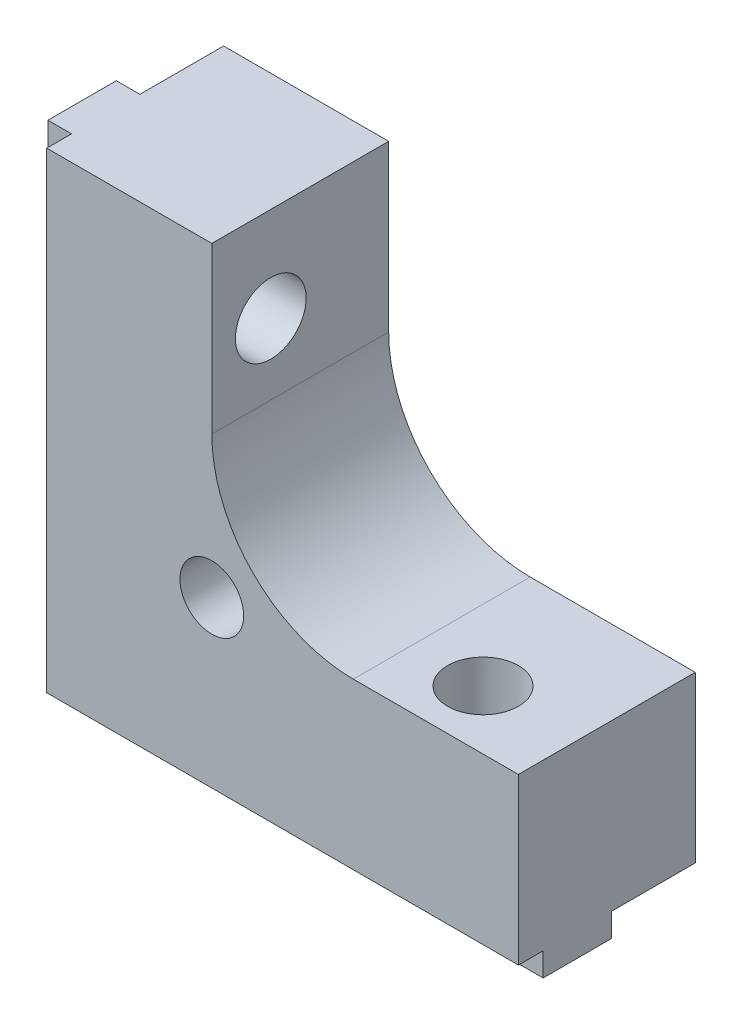
ISO-10303-21;
HEADER;
FILE_DESCRIPTION(('STEP AP214'),'2;1');
FILE_NAME('part.step','',(''),(''),'','','');
FILE_SCHEMA(('AUTOMOTIVE_DESIGN { 1 0 10303 214 1 1 1 1 }'));
ENDSEC;
DATA;
#1=APPLICATION_CONTEXT('core data for automotive mechanical design processes');
#2=APPLICATION_PROTOCOL_DEFINITION('international standard','automotive_design',2000,#1);
#3=PRODUCT_CONTEXT('',#1,'mechanical');
#4=PRODUCT('Part','Part','',(#3));
#5=PRODUCT_RELATED_PRODUCT_CATEGORY('part','',(#4));
#6=PRODUCT_DEFINITION_FORMATION('','',#4);
#7=PRODUCT_DEFINITION_CONTEXT('part definition',#1,'design');
#8=PRODUCT_DEFINITION('design','',#6,#7);
#9=PRODUCT_DEFINITION_SHAPE('','',#8);
#10=(LENGTH_UNIT() NAMED_UNIT(*) SI_UNIT(.MILLI.,.METRE.));
#11=(NAMED_UNIT(*) PLANE_ANGLE_UNIT() SI_UNIT($,.RADIAN.));
#12=(NAMED_UNIT(*) SI_UNIT($,.STERADIAN.) SOLID_ANGLE_UNIT());
#13=UNCERTAINTY_MEASURE_WITH_UNIT(LENGTH_MEASURE(1.E-05),#10,'distance_accuracy_value','');
#14=(GEOMETRIC_REPRESENTATION_CONTEXT(3) GLOBAL_UNCERTAINTY_ASSIGNED_CONTEXT((#13)) GLOBAL_UNIT_ASSIGNED_CONTEXT((#10,
#11,#12)) REPRESENTATION_CONTEXT('',''));
#15=CARTESIAN_POINT('',(0.,0.,0.));
#16=DIRECTION('',(0.,0.,1.));
#17=DIRECTION('',(1.,0.,0.));
#18=AXIS2_PLACEMENT_3D('',#15,#16,#17);
#19=CARTESIAN_POINT('',(0.,-1.,3.55));
#20=DIRECTION('',(0.,0.,1.));
#21=DIRECTION('',(1.,0.,0.));
#22=AXIS2_PLACEMENT_3D('',#19,#20,#21);
#23=PLANE('',#22);
#24=DIRECTION('',(1.,0.,0.));
#25=VECTOR('',#24,1.);
#26=CARTESIAN_POINT('',(0.,0.,3.55));
#27=LINE('',#26,#25);
#28=CARTESIAN_POINT('',(0.,0.,3.55));
#29=VERTEX_POINT('',#28);
#30=CARTESIAN_POINT('',(15.6159427126065,0.,3.55));
#31=VERTEX_POINT('',#30);
#32=EDGE_CURVE('E367',#29,#31,#27,.T.);
#33=ORIENTED_EDGE('',*,*,#32,.T.);
#34=DIRECTION('',(0.,-1.,0.));
#35=VECTOR('',#34,1.);
#36=CARTESIAN_POINT('',(15.6159427126066,20.,3.55));
#37=LINE('',#36,#35);
#38=CARTESIAN_POINT('',(15.6159427126065,-1.,3.55000000000001));
#39=VERTEX_POINT('',#38);
#40=EDGE_CURVE('E343',#31,#39,#37,.T.);
#41=ORIENTED_EDGE('',*,*,#40,.T.);
#42=DIRECTION('',(1.,0.,0.));
#43=VECTOR('',#42,1.);
#44=CARTESIAN_POINT('',(0.,-1.,3.55));
#45=LINE('',#44,#43);
#46=CARTESIAN_POINT('',(0.,-1.,3.55));
#47=VERTEX_POINT('',#46);
#48=EDGE_CURVE('E354',#47,#39,#45,.T.);
#49=ORIENTED_EDGE('',*,*,#48,.F.);
#50=DIRECTION('',(0.,1.,0.));
#51=VECTOR('',#50,1.);
#52=CARTESIAN_POINT('',(0.,-1.,3.55));
#53=LINE('',#52,#51);
#54=EDGE_CURVE('E378',#47,#29,#53,.T.);
#55=ORIENTED_EDGE('',*,*,#54,.T.);
#56=EDGE_LOOP('',(#33,#41,#49,#55));
#57=FACE_BOUND('',#56,.T.);
#58=ADVANCED_FACE('F32',(#57),#23,.F.);
#59=CARTESIAN_POINT('',(0.,-1.,6.45));
#60=DIRECTION('',(0.,0.,-1.));
#61=DIRECTION('',(-1.,0.,0.));
#62=AXIS2_PLACEMENT_3D('',#59,#60,#61);
#63=PLANE('',#62);
#64=DIRECTION('',(-1.,0.,0.));
#65=VECTOR('',#64,1.);
#66=CARTESIAN_POINT('',(0.,0.,6.45));
#67=LINE('',#66,#65);
#68=CARTESIAN_POINT('',(20.,0.,6.45));
#69=VERTEX_POINT('',#68);
#70=CARTESIAN_POINT('',(16.3840572873934,0.,6.45));
#71=VERTEX_POINT('',#70);
#72=EDGE_CURVE('E203',#69,#71,#67,.T.);
#73=ORIENTED_EDGE('',*,*,#72,.T.);
#74=DIRECTION('',(0.,-1.,0.));
#75=VECTOR('',#74,1.);
#76=CARTESIAN_POINT('',(16.3840572873934,20.,6.45));
#77=LINE('',#76,#75);
#78=CARTESIAN_POINT('',(16.3840572873934,-1.,6.45));
#79=VERTEX_POINT('',#78);
#80=EDGE_CURVE('E334',#71,#79,#77,.T.);
#81=ORIENTED_EDGE('',*,*,#80,.T.);
#82=DIRECTION('',(-1.,0.,0.));
#83=VECTOR('',#82,1.);
#84=CARTESIAN_POINT('',(0.,-1.,6.45));
#85=LINE('',#84,#83);
#86=CARTESIAN_POINT('',(20.,-1.,6.45));
#87=VERTEX_POINT('',#86);
#88=EDGE_CURVE('E360',#87,#79,#85,.T.);
#89=ORIENTED_EDGE('',*,*,#88,.F.);
#90=DIRECTION('',(0.,1.,0.));
#91=VECTOR('',#90,1.);
#92=CARTESIAN_POINT('',(20.,-1.,6.45));
#93=LINE('',#92,#91);
#94=EDGE_CURVE('E374',#87,#69,#93,.T.);
#95=ORIENTED_EDGE('',*,*,#94,.T.);
#96=EDGE_LOOP('',(#73,#81,#89,#95));
#97=FACE_BOUND('',#96,.T.);
#98=ADVANCED_FACE('F436',(#97),#63,.F.);
#99=CARTESIAN_POINT('',(0.,-1.,0.));
#100=DIRECTION('',(0.,1.,0.));
#101=DIRECTION('',(0.,0.,1.));
#102=AXIS2_PLACEMENT_3D('',#99,#100,#101);
#103=PLANE('',#102);
#104=ORIENTED_EDGE('',*,*,#88,.T.);
#105=CARTESIAN_POINT('',(16.,-1.,5.));
#106=DIRECTION('',(0.,-1.,0.));
#107=DIRECTION('',(0.,0.,-1.));
#108=AXIS2_PLACEMENT_3D('',#105,#106,#107);
#109=CIRCLE('',#108,1.5);
#110=CARTESIAN_POINT('',(16.3840572873934,-1.,3.55));
#111=VERTEX_POINT('',#110);
#112=EDGE_CURVE('E329',#111,#79,#109,.T.);
#113=ORIENTED_EDGE('',*,*,#112,.F.);
#114=CARTESIAN_POINT('',(20.,-1.,3.55000000000001));
#115=VERTEX_POINT('',#114);
#116=EDGE_CURVE('E353',#111,#115,#45,.T.);
#117=ORIENTED_EDGE('',*,*,#116,.T.);
#118=DIRECTION('',(0.,0.,1.));
#119=VECTOR('',#118,1.);
#120=CARTESIAN_POINT('',(20.,-1.,3.55000000000001));
#121=LINE('',#120,#119);
#122=EDGE_CURVE('E357',#115,#87,#121,.T.);
#123=ORIENTED_EDGE('',*,*,#122,.T.);
#124=EDGE_LOOP('',(#104,#113,#117,#123));
#125=FACE_BOUND('',#124,.T.);
#126=ADVANCED_FACE('F441',(#125),#103,.F.);
#127=CARTESIAN_POINT('',(0.,0.,10.));
#128=DIRECTION('',(0.,1.,0.));
#129=DIRECTION('',(0.,0.,1.));
#130=AXIS2_PLACEMENT_3D('',#127,#128,#129);
#131=PLANE('',#130);
#132=DIRECTION('',(0.,0.,-1.));
#133=VECTOR('',#132,1.);
#134=CARTESIAN_POINT('',(20.,0.,10.));
#135=LINE('',#134,#133);
#136=CARTESIAN_POINT('',(20.,0.,7.5));
#137=VERTEX_POINT('',#136);
#138=EDGE_CURVE('E195',#137,#69,#135,.T.);
#139=ORIENTED_EDGE('',*,*,#138,.F.);
#140=DIRECTION('',(-1.,0.,0.));
#141=VECTOR('',#140,1.);
#142=CARTESIAN_POINT('',(20.,0.,7.5));
#143=LINE('',#142,#141);
#144=CARTESIAN_POINT('',(0.,0.,7.5));
#145=VERTEX_POINT('',#144);
#146=EDGE_CURVE('E179',#137,#145,#143,.T.);
#147=ORIENTED_EDGE('',*,*,#146,.T.);
#148=DIRECTION('',(0.,0.,-1.));
#149=VECTOR('',#148,1.);
#150=CARTESIAN_POINT('',(0.,0.,10.));
#151=LINE('',#150,#149);
#152=CARTESIAN_POINT('',(0.,0.,6.45));
#153=VERTEX_POINT('',#152);
#154=EDGE_CURVE('E208',#145,#153,#151,.T.);
#155=ORIENTED_EDGE('',*,*,#154,.T.);
#156=CARTESIAN_POINT('',(15.6159427126066,0.,6.45));
#157=VERTEX_POINT('',#156);
#158=EDGE_CURVE('E370',#157,#153,#67,.T.);
#159=ORIENTED_EDGE('',*,*,#158,.F.);
#160=CARTESIAN_POINT('',(16.,0.,5.));
#161=DIRECTION('',(0.,1.,0.));
#162=DIRECTION('',(0.,0.,1.));
#163=AXIS2_PLACEMENT_3D('',#160,#161,#162);
#164=CIRCLE('',#163,1.5);
#165=EDGE_CURVE('E332',#157,#71,#164,.T.);
#166=ORIENTED_EDGE('',*,*,#165,.T.);
#167=ORIENTED_EDGE('',*,*,#72,.F.);
#168=EDGE_LOOP('',(#139,#147,#155,#159,#166,#167));
#169=FACE_BOUND('',#168,.T.);
#170=ADVANCED_FACE('F200',(#169),#131,.F.);
#171=DIRECTION('',(0.,0.,-1.));
#172=VECTOR('',#171,1.);
#173=CARTESIAN_POINT('',(0.,0.,3.55));
#174=LINE('',#173,#172);
#175=EDGE_CURVE('E349',#153,#29,#174,.T.);
#176=ORIENTED_EDGE('',*,*,#175,.F.);
#177=DIRECTION('',(1.,0.,0.));
#178=VECTOR('',#177,1.);
#179=CARTESIAN_POINT('',(-1.,0.,6.45000000000001));
#180=LINE('',#179,#178);
#181=CARTESIAN_POINT('',(-1.,0.,6.45000000000001));
#182=VERTEX_POINT('',#181);
#183=EDGE_CURVE('E264',#182,#153,#180,.T.);
#184=ORIENTED_EDGE('',*,*,#183,.F.);
#185=DIRECTION('',(0.,0.,1.));
#186=VECTOR('',#185,1.);
#187=CARTESIAN_POINT('',(-1.,0.,3.55));
#188=LINE('',#187,#186);
#189=CARTESIAN_POINT('',(-1.,0.,3.55));
#190=VERTEX_POINT('',#189);
#191=EDGE_CURVE('E242',#190,#182,#188,.T.);
#192=ORIENTED_EDGE('',*,*,#191,.F.);
#193=DIRECTION('',(1.,0.,0.));
#194=VECTOR('',#193,1.);
#195=CARTESIAN_POINT('',(-1.,0.,3.55));
#196=LINE('',#195,#194);
#197=EDGE_CURVE('E267',#190,#29,#196,.T.);
#198=ORIENTED_EDGE('',*,*,#197,.T.);
#199=EDGE_LOOP('',(#176,#184,#192,#198));
#200=FACE_BOUND('',#199,.T.);
#201=ADVANCED_FACE('F405',(#200),#131,.F.);
#202=CARTESIAN_POINT('',(16.3840572873934,0.,3.55));
#203=VERTEX_POINT('',#202);
#204=CARTESIAN_POINT('',(20.,0.,3.55000000000001));
#205=VERTEX_POINT('',#204);
#206=EDGE_CURVE('E366',#203,#205,#27,.T.);
#207=ORIENTED_EDGE('',*,*,#206,.F.);
#208=CARTESIAN_POINT('',(16.,0.,5.));
#209=DIRECTION('',(0.,1.,0.));
#210=DIRECTION('',(0.,0.,1.));
#211=AXIS2_PLACEMENT_3D('',#208,#209,#210);
#212=CIRCLE('',#211,1.5);
#213=EDGE_CURVE('E340',#203,#31,#212,.T.);
#214=ORIENTED_EDGE('',*,*,#213,.T.);
#215=ORIENTED_EDGE('',*,*,#32,.F.);
#216=CARTESIAN_POINT('',(0.,0.,0.));
#217=VERTEX_POINT('',#216);
#218=EDGE_CURVE('E205',#29,#217,#151,.T.);
#219=ORIENTED_EDGE('',*,*,#218,.T.);
#220=DIRECTION('',(1.,0.,0.));
#221=VECTOR('',#220,1.);
#222=CARTESIAN_POINT('',(0.,0.,0.));
#223=LINE('',#222,#221);
#224=CARTESIAN_POINT('',(20.,0.,0.));
#225=VERTEX_POINT('',#224);
#226=EDGE_CURVE('E273',#217,#225,#223,.T.);
#227=ORIENTED_EDGE('',*,*,#226,.T.);
#228=EDGE_CURVE('E206',#205,#225,#135,.T.);
#229=ORIENTED_EDGE('',*,*,#228,.F.);
#230=EDGE_LOOP('',(#207,#214,#215,#219,#227,#229));
#231=FACE_BOUND('',#230,.T.);
#232=ADVANCED_FACE('F422',(#231),#131,.F.);
#233=CARTESIAN_POINT('',(-1.,20.,3.55));
#234=DIRECTION('',(0.,0.,1.));
#235=DIRECTION('',(0.,-1.,0.));
#236=AXIS2_PLACEMENT_3D('',#233,#234,#235);
#237=PLANE('',#236);
#238=DIRECTION('',(0.,-1.,0.));
#239=VECTOR('',#238,1.);
#240=CARTESIAN_POINT('',(0.,20.,3.55));
#241=LINE('',#240,#239);
#242=CARTESIAN_POINT('',(0.,20.,3.55));
#243=VERTEX_POINT('',#242);
#244=CARTESIAN_POINT('',(0.,16.3840572873934,3.55));
#245=VERTEX_POINT('',#244);
#246=EDGE_CURVE('E234',#243,#245,#241,.T.);
#247=ORIENTED_EDGE('',*,*,#246,.T.);
#248=DIRECTION('',(-1.,0.,0.));
#249=VECTOR('',#248,1.);
#250=CARTESIAN_POINT('',(20.,16.3840572873934,3.55));
#251=LINE('',#250,#249);
#252=CARTESIAN_POINT('',(-1.,16.3840572873934,3.55));
#253=VERTEX_POINT('',#252);
#254=EDGE_CURVE('E221',#245,#253,#251,.T.);
#255=ORIENTED_EDGE('',*,*,#254,.T.);
#256=DIRECTION('',(0.,-1.,0.));
#257=VECTOR('',#256,1.);
#258=CARTESIAN_POINT('',(-1.,20.,3.55));
#259=LINE('',#258,#257);
#260=CARTESIAN_POINT('',(-1.,20.,3.55));
#261=VERTEX_POINT('',#260);
#262=EDGE_CURVE('E233',#261,#253,#259,.T.);
#263=ORIENTED_EDGE('',*,*,#262,.F.);
#264=DIRECTION('',(1.,0.,0.));
#265=VECTOR('',#264,1.);
#266=CARTESIAN_POINT('',(-1.,20.,3.55));
#267=LINE('',#266,#265);
#268=EDGE_CURVE('E254',#261,#243,#267,.T.);
#269=ORIENTED_EDGE('',*,*,#268,.T.);
#270=EDGE_LOOP('',(#247,#255,#263,#269));
#271=FACE_BOUND('',#270,.T.);
#272=ADVANCED_FACE('F231',(#271),#237,.F.);
#273=CARTESIAN_POINT('',(-1.,20.,6.45));
#274=DIRECTION('',(0.,0.,-1.));
#275=DIRECTION('',(0.,1.,0.));
#276=AXIS2_PLACEMENT_3D('',#273,#274,#275);
#277=PLANE('',#276);
#278=DIRECTION('',(0.,1.,0.));
#279=VECTOR('',#278,1.);
#280=CARTESIAN_POINT('',(0.,20.,6.45));
#281=LINE('',#280,#279);
#282=CARTESIAN_POINT('',(0.,15.6159427126066,6.45));
#283=VERTEX_POINT('',#282);
#284=EDGE_CURVE('E247',#153,#283,#281,.T.);
#285=ORIENTED_EDGE('',*,*,#284,.T.);
#286=DIRECTION('',(-1.,0.,0.));
#287=VECTOR('',#286,1.);
#288=CARTESIAN_POINT('',(20.,15.6159427126066,6.45));
#289=LINE('',#288,#287);
#290=CARTESIAN_POINT('',(-1.,15.6159427126066,6.45));
#291=VERTEX_POINT('',#290);
#292=EDGE_CURVE('E385',#283,#291,#289,.T.);
#293=ORIENTED_EDGE('',*,*,#292,.T.);
#294=DIRECTION('',(0.,1.,0.));
#295=VECTOR('',#294,1.);
#296=CARTESIAN_POINT('',(-1.,20.,6.45));
#297=LINE('',#296,#295);
#298=EDGE_CURVE('E250',#182,#291,#297,.T.);
#299=ORIENTED_EDGE('',*,*,#298,.F.);
#300=ORIENTED_EDGE('',*,*,#183,.T.);
#301=EDGE_LOOP('',(#285,#293,#299,#300));
#302=FACE_BOUND('',#301,.T.);
#303=ADVANCED_FACE('F409',(#302),#277,.F.);
#304=CARTESIAN_POINT('',(-1.,0.,0.));
#305=DIRECTION('',(-1.,0.,0.));
#306=DIRECTION('',(0.,-1.,0.));
#307=AXIS2_PLACEMENT_3D('',#304,#305,#306);
#308=PLANE('',#307);
#309=CARTESIAN_POINT('',(-1.,16.,5.));
#310=DIRECTION('',(-1.,0.,0.));
#311=DIRECTION('',(0.,-1.,0.));
#312=AXIS2_PLACEMENT_3D('',#309,#310,#311);
#313=CIRCLE('',#312,1.5);
#314=CARTESIAN_POINT('',(-1.,16.3840572873934,6.45));
#315=VERTEX_POINT('',#314);
#316=EDGE_CURVE('E41',#315,#253,#313,.T.);
#317=ORIENTED_EDGE('',*,*,#316,.F.);
#318=CARTESIAN_POINT('',(-1.,20.,6.45));
#319=VERTEX_POINT('',#318);
#320=EDGE_CURVE('E245',#315,#319,#297,.T.);
#321=ORIENTED_EDGE('',*,*,#320,.T.);
#322=DIRECTION('',(0.,0.,-1.));
#323=VECTOR('',#322,1.);
#324=CARTESIAN_POINT('',(-1.,20.,3.55));
#325=LINE('',#324,#323);
#326=EDGE_CURVE('E240',#319,#261,#325,.T.);
#327=ORIENTED_EDGE('',*,*,#326,.T.);
#328=ORIENTED_EDGE('',*,*,#262,.T.);
#329=EDGE_LOOP('',(#317,#321,#327,#328));
#330=FACE_BOUND('',#329,.T.);
#331=ADVANCED_FACE('F238',(#330),#308,.T.);
#332=CARTESIAN_POINT('',(0.,20.,10.));
#333=DIRECTION('',(1.,0.,0.));
#334=DIRECTION('',(0.,1.,0.));
#335=AXIS2_PLACEMENT_3D('',#332,#333,#334);
#336=PLANE('',#335);
#337=CARTESIAN_POINT('',(0.,15.6159427126066,3.55));
#338=VERTEX_POINT('',#337);
#339=EDGE_CURVE('E257',#338,#29,#241,.T.);
#340=ORIENTED_EDGE('',*,*,#339,.F.);
#341=CARTESIAN_POINT('',(0.,16.,5.));
#342=DIRECTION('',(1.,0.,0.));
#343=DIRECTION('',(0.,1.,0.));
#344=AXIS2_PLACEMENT_3D('',#341,#342,#343);
#345=CIRCLE('',#344,1.5);
#346=EDGE_CURVE('E236',#338,#245,#345,.T.);
#347=ORIENTED_EDGE('',*,*,#346,.T.);
#348=ORIENTED_EDGE('',*,*,#246,.F.);
#349=DIRECTION('',(0.,0.,-1.));
#350=VECTOR('',#349,1.);
#351=CARTESIAN_POINT('',(0.,20.,10.));
#352=LINE('',#351,#350);
#353=CARTESIAN_POINT('',(0.,20.,0.));
#354=VERTEX_POINT('',#353);
#355=EDGE_CURVE('E290',#243,#354,#352,.T.);
#356=ORIENTED_EDGE('',*,*,#355,.T.);
#357=DIRECTION('',(0.,-1.,0.));
#358=VECTOR('',#357,1.);
#359=CARTESIAN_POINT('',(0.,20.,0.));
#360=LINE('',#359,#358);
#361=EDGE_CURVE('E270',#354,#217,#360,.T.);
#362=ORIENTED_EDGE('',*,*,#361,.T.);
#363=ORIENTED_EDGE('',*,*,#218,.F.);
#364=EDGE_LOOP('',(#340,#347,#348,#356,#362,#363));
#365=FACE_BOUND('',#364,.T.);
#366=ADVANCED_FACE('F34',(#365),#336,.F.);
#367=ORIENTED_EDGE('',*,*,#154,.F.);
#368=DIRECTION('',(0.,-1.,0.));
#369=VECTOR('',#368,1.);
#370=CARTESIAN_POINT('',(0.,20.,7.5));
#371=LINE('',#370,#369);
#372=CARTESIAN_POINT('',(0.,20.,7.5));
#373=VERTEX_POINT('',#372);
#374=EDGE_CURVE('E185',#373,#145,#371,.T.);
#375=ORIENTED_EDGE('',*,*,#374,.F.);
#376=CARTESIAN_POINT('',(0.,20.,6.45));
#377=VERTEX_POINT('',#376);
#378=EDGE_CURVE('E291',#373,#377,#352,.T.);
#379=ORIENTED_EDGE('',*,*,#378,.T.);
#380=CARTESIAN_POINT('',(0.,16.3840572873934,6.45));
#381=VERTEX_POINT('',#380);
#382=EDGE_CURVE('E256',#381,#377,#281,.T.);
#383=ORIENTED_EDGE('',*,*,#382,.F.);
#384=CARTESIAN_POINT('',(0.,16.,5.));
#385=DIRECTION('',(1.,0.,0.));
#386=DIRECTION('',(0.,1.,0.));
#387=AXIS2_PLACEMENT_3D('',#384,#385,#386);
#388=CIRCLE('',#387,1.5);
#389=EDGE_CURVE('E382',#381,#283,#388,.T.);
#390=ORIENTED_EDGE('',*,*,#389,.T.);
#391=ORIENTED_EDGE('',*,*,#284,.F.);
#392=EDGE_LOOP('',(#367,#375,#379,#383,#390,#391));
#393=FACE_BOUND('',#392,.T.);
#394=ADVANCED_FACE('F412',(#393),#336,.F.);
#395=CARTESIAN_POINT('',(20.,0.,10.));
#396=DIRECTION('',(-1.,0.,0.));
#397=DIRECTION('',(0.,0.,1.));
#398=AXIS2_PLACEMENT_3D('',#395,#396,#397);
#399=PLANE('',#398);
#400=DIRECTION('',(0.,0.,-1.));
#401=VECTOR('',#400,1.);
#402=CARTESIAN_POINT('',(20.,7.,10.));
#403=LINE('',#402,#401);
#404=CARTESIAN_POINT('',(20.,7.,7.5));
#405=VERTEX_POINT('',#404);
#406=CARTESIAN_POINT('',(20.,7.,0.));
#407=VERTEX_POINT('',#406);
#408=EDGE_CURVE('E198',#405,#407,#403,.T.);
#409=ORIENTED_EDGE('',*,*,#408,.F.);
#410=DIRECTION('',(0.,-1.,0.));
#411=VECTOR('',#410,1.);
#412=CARTESIAN_POINT('',(20.,20.,7.5));
#413=LINE('',#412,#411);
#414=EDGE_CURVE('E182',#405,#137,#413,.T.);
#415=ORIENTED_EDGE('',*,*,#414,.T.);
#416=ORIENTED_EDGE('',*,*,#138,.T.);
#417=ORIENTED_EDGE('',*,*,#94,.F.);
#418=ORIENTED_EDGE('',*,*,#122,.F.);
#419=DIRECTION('',(0.,1.,0.));
#420=VECTOR('',#419,1.);
#421=CARTESIAN_POINT('',(20.,-1.,3.55000000000001));
#422=LINE('',#421,#420);
#423=EDGE_CURVE('E376',#115,#205,#422,.T.);
#424=ORIENTED_EDGE('',*,*,#423,.T.);
#425=ORIENTED_EDGE('',*,*,#228,.T.);
#426=DIRECTION('',(0.,1.,0.));
#427=VECTOR('',#426,1.);
#428=CARTESIAN_POINT('',(20.,0.,0.));
#429=LINE('',#428,#427);
#430=EDGE_CURVE('E276',#225,#407,#429,.T.);
#431=ORIENTED_EDGE('',*,*,#430,.T.);
#432=EDGE_LOOP('',(#409,#415,#416,#417,#418,#424,#425,#431));
#433=FACE_BOUND('',#432,.T.);
#434=ADVANCED_FACE('F193',(#433),#399,.F.);
#435=CARTESIAN_POINT('',(20.,7.,10.));
#436=DIRECTION('',(0.,-1.,0.));
#437=DIRECTION('',(0.,0.,-1.));
#438=AXIS2_PLACEMENT_3D('',#435,#436,#437);
#439=PLANE('',#438);
#440=CARTESIAN_POINT('',(16.,7.,5.));
#441=DIRECTION('',(0.,-1.,0.));
#442=DIRECTION('',(0.,0.,-1.));
#443=AXIS2_PLACEMENT_3D('',#440,#441,#442);
#444=CIRCLE('',#443,1.5);
#445=CARTESIAN_POINT('',(16.,7.,3.5));
#446=VERTEX_POINT('',#445);
#447=EDGE_CURVE('E346',#446,#446,#444,.T.);
#448=ORIENTED_EDGE('',*,*,#447,.T.);
#449=EDGE_LOOP('',(#448));
#450=FACE_BOUND('',#449,.T.);
#451=DIRECTION('',(0.,0.,-1.));
#452=VECTOR('',#451,1.);
#453=CARTESIAN_POINT('',(13.,7.,10.));
#454=LINE('',#453,#452);
#455=CARTESIAN_POINT('',(13.,7.,7.5));
#456=VERTEX_POINT('',#455);
#457=CARTESIAN_POINT('',(13.,7.,0.));
#458=VERTEX_POINT('',#457);
#459=EDGE_CURVE('E296',#456,#458,#454,.T.);
#460=ORIENTED_EDGE('',*,*,#459,.F.);
#461=DIRECTION('',(1.,0.,0.));
#462=VECTOR('',#461,1.);
#463=CARTESIAN_POINT('',(20.,7.,7.5));
#464=LINE('',#463,#462);
#465=EDGE_CURVE('E304',#456,#405,#464,.T.);
#466=ORIENTED_EDGE('',*,*,#465,.T.);
#467=ORIENTED_EDGE('',*,*,#408,.T.);
#468=DIRECTION('',(-1.,0.,0.));
#469=VECTOR('',#468,1.);
#470=CARTESIAN_POINT('',(20.,7.,0.));
#471=LINE('',#470,#469);
#472=EDGE_CURVE('E278',#407,#458,#471,.T.);
#473=ORIENTED_EDGE('',*,*,#472,.T.);
#474=EDGE_LOOP('',(#460,#466,#467,#473));
#475=FACE_BOUND('',#474,.T.);
#476=ADVANCED_FACE('F301',(#450,#475),#439,.F.);
#477=CARTESIAN_POINT('',(13.,13.,10.));
#478=DIRECTION('',(0.,0.,-1.));
#479=DIRECTION('',(-1.,0.,0.));
#480=AXIS2_PLACEMENT_3D('',#477,#478,#479);
#481=CYLINDRICAL_SURFACE('',#480,6.);
#482=DIRECTION('',(0.,0.,-1.));
#483=VECTOR('',#482,1.);
#484=CARTESIAN_POINT('',(7.,13.,10.));
#485=LINE('',#484,#483);
#486=CARTESIAN_POINT('',(7.,13.,7.5));
#487=VERTEX_POINT('',#486);
#488=CARTESIAN_POINT('',(7.,13.,0.));
#489=VERTEX_POINT('',#488);
#490=EDGE_CURVE('E295',#487,#489,#485,.T.);
#491=ORIENTED_EDGE('',*,*,#490,.F.);
#492=CARTESIAN_POINT('',(13.,13.,7.5));
#493=DIRECTION('',(0.,0.,-1.));
#494=DIRECTION('',(0.,1.,0.));
#495=AXIS2_PLACEMENT_3D('',#492,#493,#494);
#496=CIRCLE('',#495,6.);
#497=EDGE_CURVE('E316',#487,#456,#496,.F.);
#498=ORIENTED_EDGE('',*,*,#497,.T.);
#499=ORIENTED_EDGE('',*,*,#459,.T.);
#500=CARTESIAN_POINT('',(13.,13.,0.));
#501=DIRECTION('',(0.,0.,-1.));
#502=DIRECTION('',(-1.,0.,0.));
#503=AXIS2_PLACEMENT_3D('',#500,#501,#502);
#504=CIRCLE('',#503,6.);
#505=EDGE_CURVE('E281',#458,#489,#504,.T.);
#506=ORIENTED_EDGE('',*,*,#505,.T.);
#507=EDGE_LOOP('',(#491,#498,#499,#506));
#508=FACE_BOUND('',#507,.T.);
#509=ADVANCED_FACE('F315',(#508),#481,.F.);
#510=CARTESIAN_POINT('',(7.,13.,10.));
#511=DIRECTION('',(-1.,0.,0.));
#512=DIRECTION('',(0.,-1.,0.));
#513=AXIS2_PLACEMENT_3D('',#510,#511,#512);
#514=PLANE('',#513);
#515=CARTESIAN_POINT('',(7.,16.,5.));
#516=DIRECTION('',(-1.,0.,0.));
#517=DIRECTION('',(0.,-1.,0.));
#518=AXIS2_PLACEMENT_3D('',#515,#516,#517);
#519=CIRCLE('',#518,1.5);
#520=CARTESIAN_POINT('',(7.,14.5,5.));
#521=VERTEX_POINT('',#520);
#522=EDGE_CURVE('E235',#521,#521,#519,.T.);
#523=ORIENTED_EDGE('',*,*,#522,.T.);
#524=EDGE_LOOP('',(#523));
#525=FACE_BOUND('',#524,.T.);
#526=DIRECTION('',(0.,0.,-1.));
#527=VECTOR('',#526,1.);
#528=CARTESIAN_POINT('',(7.,20.,10.));
#529=LINE('',#528,#527);
#530=CARTESIAN_POINT('',(7.,20.,7.5));
#531=VERTEX_POINT('',#530);
#532=CARTESIAN_POINT('',(7.,20.,0.));
#533=VERTEX_POINT('',#532);
#534=EDGE_CURVE('E293',#531,#533,#529,.T.);
#535=ORIENTED_EDGE('',*,*,#534,.F.);
#536=DIRECTION('',(0.,-1.,0.));
#537=VECTOR('',#536,1.);
#538=CARTESIAN_POINT('',(7.,13.,7.5));
#539=LINE('',#538,#537);
#540=EDGE_CURVE('E48',#531,#487,#539,.T.);
#541=ORIENTED_EDGE('',*,*,#540,.T.);
#542=ORIENTED_EDGE('',*,*,#490,.T.);
#543=DIRECTION('',(0.,1.,0.));
#544=VECTOR('',#543,1.);
#545=CARTESIAN_POINT('',(7.,13.,0.));
#546=LINE('',#545,#544);
#547=EDGE_CURVE('E284',#489,#533,#546,.T.);
#548=ORIENTED_EDGE('',*,*,#547,.T.);
#549=EDGE_LOOP('',(#535,#541,#542,#548));
#550=FACE_BOUND('',#549,.T.);
#551=ADVANCED_FACE('F319',(#525,#550),#514,.F.);
#552=CARTESIAN_POINT('',(7.,20.,10.));
#553=DIRECTION('',(0.,-1.,0.));
#554=DIRECTION('',(0.,0.,-1.));
#555=AXIS2_PLACEMENT_3D('',#552,#553,#554);
#556=PLANE('',#555);
#557=ORIENTED_EDGE('',*,*,#378,.F.);
#558=DIRECTION('',(-1.,0.,0.));
#559=VECTOR('',#558,1.);
#560=CARTESIAN_POINT('',(20.,20.,7.5));
#561=LINE('',#560,#559);
#562=EDGE_CURVE('E189',#531,#373,#561,.T.);
#563=ORIENTED_EDGE('',*,*,#562,.F.);
#564=ORIENTED_EDGE('',*,*,#534,.T.);
#565=DIRECTION('',(-1.,0.,0.));
#566=VECTOR('',#565,1.);
#567=CARTESIAN_POINT('',(7.,20.,0.));
#568=LINE('',#567,#566);
#569=EDGE_CURVE('E287',#533,#354,#568,.T.);
#570=ORIENTED_EDGE('',*,*,#569,.T.);
#571=ORIENTED_EDGE('',*,*,#355,.F.);
#572=ORIENTED_EDGE('',*,*,#268,.F.);
#573=ORIENTED_EDGE('',*,*,#326,.F.);
#574=DIRECTION('',(1.,0.,0.));
#575=VECTOR('',#574,1.);
#576=CARTESIAN_POINT('',(-1.,20.,6.45));
#577=LINE('',#576,#575);
#578=EDGE_CURVE('E261',#319,#377,#577,.T.);
#579=ORIENTED_EDGE('',*,*,#578,.T.);
#580=EDGE_LOOP('',(#557,#563,#564,#570,#571,#572,#573,#579));
#581=FACE_BOUND('',#580,.T.);
#582=ADVANCED_FACE('F419',(#581),#556,.F.);
#583=CARTESIAN_POINT('',(13.,13.,0.));
#584=DIRECTION('',(0.,0.,-1.));
#585=DIRECTION('',(-1.,0.,0.));
#586=AXIS2_PLACEMENT_3D('',#583,#584,#585);
#587=PLANE('',#586);
#588=CARTESIAN_POINT('',(7.,7.,0.));
#589=DIRECTION('',(0.,0.,1.));
#590=DIRECTION('',(1.,0.,0.));
#591=AXIS2_PLACEMENT_3D('',#588,#589,#590);
#592=CIRCLE('',#591,1.35);
#593=CARTESIAN_POINT('',(8.35,7.,0.));
#594=VERTEX_POINT('',#593);
#595=EDGE_CURVE('E326',#594,#594,#592,.T.);
#596=ORIENTED_EDGE('',*,*,#595,.T.);
#597=EDGE_LOOP('',(#596));
#598=FACE_BOUND('',#597,.T.);
#599=ORIENTED_EDGE('',*,*,#361,.F.);
#600=ORIENTED_EDGE('',*,*,#569,.F.);
#601=ORIENTED_EDGE('',*,*,#547,.F.);
#602=ORIENTED_EDGE('',*,*,#505,.F.);
#603=ORIENTED_EDGE('',*,*,#472,.F.);
#604=ORIENTED_EDGE('',*,*,#430,.F.);
#605=ORIENTED_EDGE('',*,*,#226,.F.);
#606=EDGE_LOOP('',(#599,#600,#601,#602,#603,#604,#605));
#607=FACE_BOUND('',#606,.T.);
#608=ADVANCED_FACE('F311',(#598,#607),#587,.T.);
#609=CARTESIAN_POINT('',(-1.,15.6159427126066,3.55));
#610=VERTEX_POINT('',#609);
#611=EDGE_CURVE('E243',#610,#190,#259,.T.);
#612=ORIENTED_EDGE('',*,*,#611,.F.);
#613=DIRECTION('',(-1.,0.,0.));
#614=VECTOR('',#613,1.);
#615=CARTESIAN_POINT('',(20.,15.6159427126065,3.55));
#616=LINE('',#615,#614);
#617=EDGE_CURVE('E387',#610,#338,#616,.F.);
#618=ORIENTED_EDGE('',*,*,#617,.T.);
#619=ORIENTED_EDGE('',*,*,#339,.T.);
#620=ORIENTED_EDGE('',*,*,#197,.F.);
#621=EDGE_LOOP('',(#612,#618,#619,#620));
#622=FACE_BOUND('',#621,.T.);
#623=ADVANCED_FACE('F397',(#622),#237,.F.);
#624=ORIENTED_EDGE('',*,*,#320,.F.);
#625=DIRECTION('',(-1.,0.,0.));
#626=VECTOR('',#625,1.);
#627=CARTESIAN_POINT('',(20.,16.3840572873934,6.45));
#628=LINE('',#627,#626);
#629=EDGE_CURVE('E224',#315,#381,#628,.F.);
#630=ORIENTED_EDGE('',*,*,#629,.T.);
#631=ORIENTED_EDGE('',*,*,#382,.T.);
#632=ORIENTED_EDGE('',*,*,#578,.F.);
#633=EDGE_LOOP('',(#624,#630,#631,#632));
#634=FACE_BOUND('',#633,.T.);
#635=ADVANCED_FACE('F417',(#634),#277,.F.);
#636=EDGE_CURVE('E213',#610,#291,#313,.T.);
#637=ORIENTED_EDGE('',*,*,#636,.F.);
#638=ORIENTED_EDGE('',*,*,#611,.T.);
#639=ORIENTED_EDGE('',*,*,#191,.T.);
#640=ORIENTED_EDGE('',*,*,#298,.T.);
#641=EDGE_LOOP('',(#637,#638,#639,#640));
#642=FACE_BOUND('',#641,.T.);
#643=ADVANCED_FACE('F401',(#642),#308,.T.);
#644=CARTESIAN_POINT('',(20.,16.,5.));
#645=DIRECTION('',(-1.,0.,0.));
#646=DIRECTION('',(0.,-1.,0.));
#647=AXIS2_PLACEMENT_3D('',#644,#645,#646);
#648=CYLINDRICAL_SURFACE('',#647,1.5);
#649=ORIENTED_EDGE('',*,*,#346,.F.);
#650=ORIENTED_EDGE('',*,*,#617,.F.);
#651=ORIENTED_EDGE('',*,*,#636,.T.);
#652=ORIENTED_EDGE('',*,*,#292,.F.);
#653=ORIENTED_EDGE('',*,*,#389,.F.);
#654=ORIENTED_EDGE('',*,*,#629,.F.);
#655=ORIENTED_EDGE('',*,*,#316,.T.);
#656=ORIENTED_EDGE('',*,*,#254,.F.);
#657=EDGE_LOOP('',(#649,#650,#651,#652,#653,#654,#655,#656));
#658=FACE_BOUND('',#657,.T.);
#659=ORIENTED_EDGE('',*,*,#522,.F.);
#660=EDGE_LOOP('',(#659));
#661=FACE_BOUND('',#660,.T.);
#662=ADVANCED_FACE('F219',(#658,#661),#648,.F.);
#663=CARTESIAN_POINT('',(0.,-1.,3.55));
#664=DIRECTION('',(1.,0.,0.));
#665=DIRECTION('',(0.,0.,-1.));
#666=AXIS2_PLACEMENT_3D('',#663,#664,#665);
#667=PLANE('',#666);
#668=ORIENTED_EDGE('',*,*,#175,.T.);
#669=ORIENTED_EDGE('',*,*,#54,.F.);
#670=DIRECTION('',(0.,0.,-1.));
#671=VECTOR('',#670,1.);
#672=CARTESIAN_POINT('',(0.,-1.,3.55));
#673=LINE('',#672,#671);
#674=CARTESIAN_POINT('',(0.,-1.,6.45));
#675=VERTEX_POINT('',#674);
#676=EDGE_CURVE('E350',#675,#47,#673,.T.);
#677=ORIENTED_EDGE('',*,*,#676,.F.);
#678=DIRECTION('',(0.,1.,0.));
#679=VECTOR('',#678,1.);
#680=CARTESIAN_POINT('',(0.,-1.,6.45));
#681=LINE('',#680,#679);
#682=EDGE_CURVE('E363',#675,#153,#681,.T.);
#683=ORIENTED_EDGE('',*,*,#682,.T.);
#684=EDGE_LOOP('',(#668,#669,#677,#683));
#685=FACE_BOUND('',#684,.T.);
#686=ADVANCED_FACE('F427',(#685),#667,.F.);
#687=ORIENTED_EDGE('',*,*,#116,.F.);
#688=DIRECTION('',(0.,-1.,0.));
#689=VECTOR('',#688,1.);
#690=CARTESIAN_POINT('',(16.3840572873934,20.,3.55));
#691=LINE('',#690,#689);
#692=EDGE_CURVE('E337',#111,#203,#691,.F.);
#693=ORIENTED_EDGE('',*,*,#692,.T.);
#694=ORIENTED_EDGE('',*,*,#206,.T.);
#695=ORIENTED_EDGE('',*,*,#423,.F.);
#696=EDGE_LOOP('',(#687,#693,#694,#695));
#697=FACE_BOUND('',#696,.T.);
#698=ADVANCED_FACE('F445',(#697),#23,.F.);
#699=CARTESIAN_POINT('',(15.6159427126066,-1.,6.45));
#700=VERTEX_POINT('',#699);
#701=EDGE_CURVE('E359',#700,#675,#85,.T.);
#702=ORIENTED_EDGE('',*,*,#701,.F.);
#703=DIRECTION('',(0.,-1.,0.));
#704=VECTOR('',#703,1.);
#705=CARTESIAN_POINT('',(15.6159427126066,20.,6.45));
#706=LINE('',#705,#704);
#707=EDGE_CURVE('E56',#700,#157,#706,.F.);
#708=ORIENTED_EDGE('',*,*,#707,.T.);
#709=ORIENTED_EDGE('',*,*,#158,.T.);
#710=ORIENTED_EDGE('',*,*,#682,.F.);
#711=EDGE_LOOP('',(#702,#708,#709,#710));
#712=FACE_BOUND('',#711,.T.);
#713=ADVANCED_FACE('F432',(#712),#63,.F.);
#714=ORIENTED_EDGE('',*,*,#48,.T.);
#715=CARTESIAN_POINT('',(16.,-1.,5.));
#716=DIRECTION('',(0.,1.,0.));
#717=DIRECTION('',(0.,0.,1.));
#718=AXIS2_PLACEMENT_3D('',#715,#716,#717);
#719=CIRCLE('',#718,1.5);
#720=EDGE_CURVE('E11',#39,#700,#719,.T.);
#721=ORIENTED_EDGE('',*,*,#720,.T.);
#722=ORIENTED_EDGE('',*,*,#701,.T.);
#723=ORIENTED_EDGE('',*,*,#676,.T.);
#724=EDGE_LOOP('',(#714,#721,#722,#723));
#725=FACE_BOUND('',#724,.T.);
#726=ADVANCED_FACE('F449',(#725),#103,.F.);
#727=CARTESIAN_POINT('',(16.,20.,5.));
#728=DIRECTION('',(0.,-1.,0.));
#729=DIRECTION('',(0.,0.,-1.));
#730=AXIS2_PLACEMENT_3D('',#727,#728,#729);
#731=CYLINDRICAL_SURFACE('',#730,1.5);
#732=ORIENTED_EDGE('',*,*,#213,.F.);
#733=ORIENTED_EDGE('',*,*,#692,.F.);
#734=ORIENTED_EDGE('',*,*,#112,.T.);
#735=ORIENTED_EDGE('',*,*,#80,.F.);
#736=ORIENTED_EDGE('',*,*,#165,.F.);
#737=ORIENTED_EDGE('',*,*,#707,.F.);
#738=ORIENTED_EDGE('',*,*,#720,.F.);
#739=ORIENTED_EDGE('',*,*,#40,.F.);
#740=EDGE_LOOP('',(#732,#733,#734,#735,#736,#737,#738,#739));
#741=FACE_BOUND('',#740,.T.);
#742=ORIENTED_EDGE('',*,*,#447,.F.);
#743=EDGE_LOOP('',(#742));
#744=FACE_BOUND('',#743,.T.);
#745=ADVANCED_FACE('F446',(#741,#744),#731,.F.);
#746=CARTESIAN_POINT('',(7.,7.,0.));
#747=DIRECTION('',(0.,0.,1.));
#748=DIRECTION('',(1.,0.,0.));
#749=AXIS2_PLACEMENT_3D('',#746,#747,#748);
#750=CYLINDRICAL_SURFACE('',#749,1.35);
#751=CARTESIAN_POINT('',(7.,7.,7.5));
#752=DIRECTION('',(0.,0.,-1.));
#753=DIRECTION('',(0.,1.,0.));
#754=AXIS2_PLACEMENT_3D('',#751,#752,#753);
#755=CIRCLE('',#754,1.35);
#756=CARTESIAN_POINT('',(7.,8.35,7.5));
#757=VERTEX_POINT('',#756);
#758=EDGE_CURVE('E36',#757,#757,#755,.F.);
#759=ORIENTED_EDGE('',*,*,#758,.T.);
#760=EDGE_LOOP('',(#759));
#761=FACE_BOUND('',#760,.T.);
#762=ORIENTED_EDGE('',*,*,#595,.F.);
#763=EDGE_LOOP('',(#762));
#764=FACE_BOUND('',#763,.T.);
#765=ADVANCED_FACE('F456',(#761,#764),#750,.F.);
#766=CARTESIAN_POINT('',(20.,20.,7.5));
#767=DIRECTION('',(0.,0.,-1.));
#768=DIRECTION('',(0.,1.,0.));
#769=AXIS2_PLACEMENT_3D('',#766,#767,#768);
#770=PLANE('',#769);
#771=ORIENTED_EDGE('',*,*,#758,.F.);
#772=EDGE_LOOP('',(#771));
#773=FACE_BOUND('',#772,.T.);
#774=ORIENTED_EDGE('',*,*,#497,.F.);
#775=ORIENTED_EDGE('',*,*,#540,.F.);
#776=ORIENTED_EDGE('',*,*,#562,.T.);
#777=ORIENTED_EDGE('',*,*,#374,.T.);
#778=ORIENTED_EDGE('',*,*,#146,.F.);
#779=ORIENTED_EDGE('',*,*,#414,.F.);
#780=ORIENTED_EDGE('',*,*,#465,.F.);
#781=EDGE_LOOP('',(#774,#775,#776,#777,#778,#779,#780));
#782=FACE_BOUND('',#781,.T.);
#783=ADVANCED_FACE('F181',(#773,#782),#770,.F.);
#784=CLOSED_SHELL('',(#58,#98,#126,#170,#201,#232,#272,#303,#331,#366,#394,#434,#476,#509,#551,
#582,#608,#623,#635,#643,#662,#686,#698,#713,#726,#745,#765,#783));
#785=MANIFOLD_SOLID_BREP('B2',#784);
#786=ADVANCED_BREP_SHAPE_REPRESENTATION('',(#18,#785),#14);
#787=SHAPE_DEFINITION_REPRESENTATION(#9,#786);
ENDSEC;
END-ISO-10303-21;
